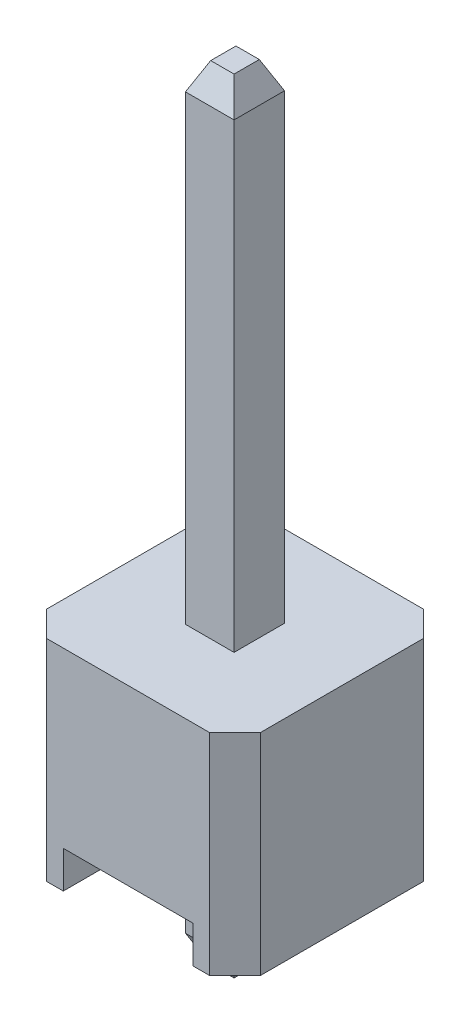
ISO-10303-21;
HEADER;
FILE_DESCRIPTION(('STEP AP214'),'2;1');
FILE_NAME('part.step','',(''),(''),'','','');
FILE_SCHEMA(('AUTOMOTIVE_DESIGN { 1 0 10303 214 1 1 1 1 }'));
ENDSEC;
DATA;
#1=APPLICATION_CONTEXT('core data for automotive mechanical design processes');
#2=APPLICATION_PROTOCOL_DEFINITION('international standard','automotive_design',2000,#1);
#3=PRODUCT_CONTEXT('',#1,'mechanical');
#4=PRODUCT('Part','Part','',(#3));
#5=PRODUCT_RELATED_PRODUCT_CATEGORY('part','',(#4));
#6=PRODUCT_DEFINITION_FORMATION('','',#4);
#7=PRODUCT_DEFINITION_CONTEXT('part definition',#1,'design');
#8=PRODUCT_DEFINITION('design','',#6,#7);
#9=PRODUCT_DEFINITION_SHAPE('','',#8);
#10=(LENGTH_UNIT() NAMED_UNIT(*) SI_UNIT(.MILLI.,.METRE.));
#11=(NAMED_UNIT(*) PLANE_ANGLE_UNIT() SI_UNIT($,.RADIAN.));
#12=(NAMED_UNIT(*) SI_UNIT($,.STERADIAN.) SOLID_ANGLE_UNIT());
#13=UNCERTAINTY_MEASURE_WITH_UNIT(LENGTH_MEASURE(1.E-05),#10,'distance_accuracy_value','');
#14=(GEOMETRIC_REPRESENTATION_CONTEXT(3) GLOBAL_UNCERTAINTY_ASSIGNED_CONTEXT((#13)) GLOBAL_UNIT_ASSIGNED_CONTEXT((#10,
#11,#12)) REPRESENTATION_CONTEXT('',''));
#15=CARTESIAN_POINT('',(0.,0.,0.));
#16=DIRECTION('',(0.,0.,1.));
#17=DIRECTION('',(1.,0.,0.));
#18=AXIS2_PLACEMENT_3D('',#15,#16,#17);
#19=CARTESIAN_POINT('',(-19.1812561045914,-5.69124998633488,0.951627111171994));
#20=DIRECTION('',(0.,-1.,0.));
#21=DIRECTION('',(0.,0.,-1.));
#22=AXIS2_PLACEMENT_3D('',#19,#20,#21);
#23=PLANE('',#22);
#24=DIRECTION('',(0.,0.,1.));
#25=VECTOR('',#24,1.);
#26=CARTESIAN_POINT('',(-19.0312561045914,-5.69124998633488,1.55162711117199));
#27=LINE('',#26,#25);
#28=CARTESIAN_POINT('',(-19.0312561045914,-5.69124998633488,1.40162711117199));
#29=VERTEX_POINT('',#28);
#30=CARTESIAN_POINT('',(-19.0312561045914,-5.69124998633488,1.10162711117199));
#31=VERTEX_POINT('',#30);
#32=EDGE_CURVE('E194',#29,#31,#27,.F.);
#33=ORIENTED_EDGE('',*,*,#32,.T.);
#34=DIRECTION('',(1.,0.,0.));
#35=VECTOR('',#34,1.);
#36=CARTESIAN_POINT('',(-19.1812561045914,-5.69124998633488,1.10162711117199));
#37=LINE('',#36,#35);
#38=CARTESIAN_POINT('',(-18.7537499744834,-5.69124998633488,1.10162711117199));
#39=VERTEX_POINT('',#38);
#40=EDGE_CURVE('E179',#31,#39,#37,.T.);
#41=ORIENTED_EDGE('',*,*,#40,.T.);
#42=DIRECTION('',(0.,0.,1.));
#43=VECTOR('',#42,1.);
#44=CARTESIAN_POINT('',(-18.7537499744834,-5.69124998633488,0.951627111171994));
#45=LINE('',#44,#43);
#46=CARTESIAN_POINT('',(-18.7537499744834,-5.69124998633488,1.40162711117199));
#47=VERTEX_POINT('',#46);
#48=EDGE_CURVE('E20',#39,#47,#45,.T.);
#49=ORIENTED_EDGE('',*,*,#48,.T.);
#50=DIRECTION('',(1.,0.,0.));
#51=VECTOR('',#50,1.);
#52=CARTESIAN_POINT('',(-18.6037499744834,-5.69124998633488,1.40162711117199));
#53=LINE('',#52,#51);
#54=EDGE_CURVE('E174',#47,#29,#53,.F.);
#55=ORIENTED_EDGE('',*,*,#54,.T.);
#56=EDGE_LOOP('',(#33,#41,#49,#55));
#57=FACE_BOUND('',#56,.T.);
#58=ADVANCED_FACE('F17',(#57),#23,.T.);
#59=CARTESIAN_POINT('',(-18.6037499744834,-5.36957394825845,0.951627111171994));
#60=DIRECTION('',(-0.90630778703665,0.4226182617407,0.));
#61=DIRECTION('',(-0.4226182617407,-0.90630778703665,0.));
#62=AXIS2_PLACEMENT_3D('',#59,#60,#61);
#63=PLANE('',#62);
#64=DIRECTION('',(0.,0.,-1.));
#65=VECTOR('',#64,1.);
#66=CARTESIAN_POINT('',(-18.6037499744834,-5.36957394825845,0.951627111171994));
#67=LINE('',#66,#65);
#68=CARTESIAN_POINT('',(-18.6037499744834,-5.36957394825845,1.55162711117199));
#69=VERTEX_POINT('',#68);
#70=CARTESIAN_POINT('',(-18.6037499744834,-5.36957394825845,0.951627111171994));
#71=VERTEX_POINT('',#70);
#72=EDGE_CURVE('E186',#69,#71,#67,.T.);
#73=ORIENTED_EDGE('',*,*,#72,.F.);
#74=DIRECTION('',(-0.389281620635035,-0.834817129478983,-0.389281620635025));
#75=VECTOR('',#74,1.);
#76=CARTESIAN_POINT('',(-18.6037499744834,-5.36957394825845,1.55162711117199));
#77=LINE('',#76,#75);
#78=EDGE_CURVE('E182',#69,#47,#77,.T.);
#79=ORIENTED_EDGE('',*,*,#78,.T.);
#80=ORIENTED_EDGE('',*,*,#48,.F.);
#81=DIRECTION('',(0.389281620635035,0.834817129478983,-0.389281620635025));
#82=VECTOR('',#81,1.);
#83=CARTESIAN_POINT('',(-18.7537499744834,-5.69124998633488,1.10162711117199));
#84=LINE('',#83,#82);
#85=EDGE_CURVE('E202',#39,#71,#84,.T.);
#86=ORIENTED_EDGE('',*,*,#85,.T.);
#87=EDGE_LOOP('',(#73,#79,#80,#86));
#88=FACE_BOUND('',#87,.T.);
#89=ADVANCED_FACE('F184',(#88),#63,.F.);
#90=CARTESIAN_POINT('',(-18.6037499744834,-5.36957394825845,1.55162711117199));
#91=DIRECTION('',(0.,0.422618261740701,-0.906307787036649));
#92=DIRECTION('',(0.,0.906307787036649,0.422618261740701));
#93=AXIS2_PLACEMENT_3D('',#90,#91,#92);
#94=PLANE('',#93);
#95=ORIENTED_EDGE('',*,*,#54,.F.);
#96=ORIENTED_EDGE('',*,*,#78,.F.);
#97=DIRECTION('',(1.,0.,0.));
#98=VECTOR('',#97,1.);
#99=CARTESIAN_POINT('',(-18.6037499744834,-5.36957394825845,1.55162711117199));
#100=LINE('',#99,#98);
#101=CARTESIAN_POINT('',(-19.1812561045914,-5.36957394825845,1.55162711117199));
#102=VERTEX_POINT('',#101);
#103=EDGE_CURVE('E205',#102,#69,#100,.T.);
#104=ORIENTED_EDGE('',*,*,#103,.F.);
#105=DIRECTION('',(0.389281620635027,-0.834817129478987,-0.389281620635025));
#106=VECTOR('',#105,1.);
#107=CARTESIAN_POINT('',(-19.1812561045914,-5.36957394825845,1.55162711117199));
#108=LINE('',#107,#106);
#109=EDGE_CURVE('E191',#102,#29,#108,.T.);
#110=ORIENTED_EDGE('',*,*,#109,.T.);
#111=EDGE_LOOP('',(#95,#96,#104,#110));
#112=FACE_BOUND('',#111,.T.);
#113=ADVANCED_FACE('F189',(#112),#94,.F.);
#114=CARTESIAN_POINT('',(-19.1812561045914,-5.36957394825845,1.55162711117199));
#115=DIRECTION('',(0.906307787036649,0.422618261740701,0.));
#116=DIRECTION('',(-0.422618261740701,0.906307787036649,0.));
#117=AXIS2_PLACEMENT_3D('',#114,#115,#116);
#118=PLANE('',#117);
#119=ORIENTED_EDGE('',*,*,#32,.F.);
#120=ORIENTED_EDGE('',*,*,#109,.F.);
#121=DIRECTION('',(0.,0.,1.));
#122=VECTOR('',#121,1.);
#123=CARTESIAN_POINT('',(-19.1812561045914,-5.36957394825845,1.55162711117199));
#124=LINE('',#123,#122);
#125=CARTESIAN_POINT('',(-19.1812561045914,-5.36957394825845,0.951627111171994));
#126=VERTEX_POINT('',#125);
#127=EDGE_CURVE('E211',#126,#102,#124,.T.);
#128=ORIENTED_EDGE('',*,*,#127,.F.);
#129=DIRECTION('',(0.389281620635027,-0.834817129478986,0.389281620635026));
#130=VECTOR('',#129,1.);
#131=CARTESIAN_POINT('',(-19.1812561045914,-5.36957394825845,0.951627111171994));
#132=LINE('',#131,#130);
#133=EDGE_CURVE('E198',#126,#31,#132,.T.);
#134=ORIENTED_EDGE('',*,*,#133,.T.);
#135=EDGE_LOOP('',(#119,#120,#128,#134));
#136=FACE_BOUND('',#135,.T.);
#137=ADVANCED_FACE('F518',(#136),#118,.F.);
#138=CARTESIAN_POINT('',(-19.1812561045914,-5.36957394825845,0.951627111171994));
#139=DIRECTION('',(0.,0.422618261740701,0.906307787036649));
#140=DIRECTION('',(0.,-0.906307787036649,0.422618261740701));
#141=AXIS2_PLACEMENT_3D('',#138,#139,#140);
#142=PLANE('',#141);
#143=ORIENTED_EDGE('',*,*,#40,.F.);
#144=ORIENTED_EDGE('',*,*,#133,.F.);
#145=DIRECTION('',(-1.,0.,0.));
#146=VECTOR('',#145,1.);
#147=CARTESIAN_POINT('',(-19.1812561045914,-5.36957394825845,0.951627111171994));
#148=LINE('',#147,#146);
#149=EDGE_CURVE('E220',#71,#126,#148,.T.);
#150=ORIENTED_EDGE('',*,*,#149,.F.);
#151=ORIENTED_EDGE('',*,*,#85,.F.);
#152=EDGE_LOOP('',(#143,#144,#150,#151));
#153=FACE_BOUND('',#152,.T.);
#154=ADVANCED_FACE('F514',(#153),#142,.F.);
#155=CARTESIAN_POINT('',(-18.6037499744834,-5.69124998633488,0.951627111171994));
#156=DIRECTION('',(1.,0.,0.));
#157=DIRECTION('',(0.,0.,-1.));
#158=AXIS2_PLACEMENT_3D('',#155,#156,#157);
#159=PLANE('',#158);
#160=DIRECTION('',(0.,1.,0.));
#161=VECTOR('',#160,1.);
#162=CARTESIAN_POINT('',(-18.6037499744834,-5.69124998633488,0.951627111171994));
#163=LINE('',#162,#161);
#164=CARTESIAN_POINT('',(-18.6037499744834,-4.25124998633488,0.951627111171994));
#165=VERTEX_POINT('',#164);
#166=EDGE_CURVE('E217',#165,#71,#163,.F.);
#167=ORIENTED_EDGE('',*,*,#166,.F.);
#168=DIRECTION('',(0.,0.,1.));
#169=VECTOR('',#168,1.);
#170=CARTESIAN_POINT('',(-18.6037499744834,-4.25124998633488,2.52162711117199));
#171=LINE('',#170,#169);
#172=CARTESIAN_POINT('',(-18.6037499744834,-4.25124998633488,1.55162711117199));
#173=VERTEX_POINT('',#172);
#174=EDGE_CURVE('E230',#165,#173,#171,.T.);
#175=ORIENTED_EDGE('',*,*,#174,.T.);
#176=DIRECTION('',(0.,1.,0.));
#177=VECTOR('',#176,1.);
#178=CARTESIAN_POINT('',(-18.6037499744834,-5.69124998633488,1.55162711117199));
#179=LINE('',#178,#177);
#180=EDGE_CURVE('E208',#69,#173,#179,.T.);
#181=ORIENTED_EDGE('',*,*,#180,.F.);
#182=ORIENTED_EDGE('',*,*,#72,.T.);
#183=EDGE_LOOP('',(#167,#175,#181,#182));
#184=FACE_BOUND('',#183,.T.);
#185=ADVANCED_FACE('F510',(#184),#159,.T.);
#186=CARTESIAN_POINT('',(-18.6037499744834,-5.69124998633488,1.55162711117199));
#187=DIRECTION('',(0.,0.,1.));
#188=DIRECTION('',(1.,0.,0.));
#189=AXIS2_PLACEMENT_3D('',#186,#187,#188);
#190=PLANE('',#189);
#191=ORIENTED_EDGE('',*,*,#180,.T.);
#192=DIRECTION('',(1.,0.,0.));
#193=VECTOR('',#192,1.);
#194=CARTESIAN_POINT('',(-18.1225030395374,-4.25124998633488,1.55162711117199));
#195=LINE('',#194,#193);
#196=CARTESIAN_POINT('',(-19.1812561045914,-4.25124998633488,1.55162711117199));
#197=VERTEX_POINT('',#196);
#198=EDGE_CURVE('E232',#173,#197,#195,.F.);
#199=ORIENTED_EDGE('',*,*,#198,.T.);
#200=DIRECTION('',(0.,1.,0.));
#201=VECTOR('',#200,1.);
#202=CARTESIAN_POINT('',(-19.1812561045914,-5.69124998633488,1.55162711117199));
#203=LINE('',#202,#201);
#204=EDGE_CURVE('E214',#102,#197,#203,.T.);
#205=ORIENTED_EDGE('',*,*,#204,.F.);
#206=ORIENTED_EDGE('',*,*,#103,.T.);
#207=EDGE_LOOP('',(#191,#199,#205,#206));
#208=FACE_BOUND('',#207,.T.);
#209=ADVANCED_FACE('F506',(#208),#190,.T.);
#210=CARTESIAN_POINT('',(-19.1812561045914,-5.69124998633488,1.55162711117199));
#211=DIRECTION('',(-1.,0.,0.));
#212=DIRECTION('',(0.,0.,1.));
#213=AXIS2_PLACEMENT_3D('',#210,#211,#212);
#214=PLANE('',#213);
#215=ORIENTED_EDGE('',*,*,#204,.T.);
#216=DIRECTION('',(0.,0.,1.));
#217=VECTOR('',#216,1.);
#218=CARTESIAN_POINT('',(-19.1812561045914,-4.25124998633488,2.52162711117199));
#219=LINE('',#218,#217);
#220=CARTESIAN_POINT('',(-19.1812561045914,-4.25124998633488,0.951627111171994));
#221=VERTEX_POINT('',#220);
#222=EDGE_CURVE('E234',#197,#221,#219,.F.);
#223=ORIENTED_EDGE('',*,*,#222,.T.);
#224=DIRECTION('',(0.,1.,0.));
#225=VECTOR('',#224,1.);
#226=CARTESIAN_POINT('',(-19.1812561045914,-5.69124998633488,0.951627111171994));
#227=LINE('',#226,#225);
#228=EDGE_CURVE('E223',#126,#221,#227,.T.);
#229=ORIENTED_EDGE('',*,*,#228,.F.);
#230=ORIENTED_EDGE('',*,*,#127,.T.);
#231=EDGE_LOOP('',(#215,#223,#229,#230));
#232=FACE_BOUND('',#231,.T.);
#233=ADVANCED_FACE('F502',(#232),#214,.T.);
#234=CARTESIAN_POINT('',(-19.1812561045914,-5.69124998633488,0.951627111171994));
#235=DIRECTION('',(0.,0.,-1.));
#236=DIRECTION('',(-1.,0.,0.));
#237=AXIS2_PLACEMENT_3D('',#234,#235,#236);
#238=PLANE('',#237);
#239=ORIENTED_EDGE('',*,*,#228,.T.);
#240=DIRECTION('',(1.,0.,0.));
#241=VECTOR('',#240,1.);
#242=CARTESIAN_POINT('',(-18.1225030395374,-4.25124998633488,0.951627111171994));
#243=LINE('',#242,#241);
#244=EDGE_CURVE('E236',#221,#165,#243,.T.);
#245=ORIENTED_EDGE('',*,*,#244,.T.);
#246=ORIENTED_EDGE('',*,*,#166,.T.);
#247=ORIENTED_EDGE('',*,*,#149,.T.);
#248=EDGE_LOOP('',(#239,#245,#246,#247));
#249=FACE_BOUND('',#248,.T.);
#250=ADVANCED_FACE('F498',(#249),#238,.T.);
#251=CARTESIAN_POINT('',(-18.1225030395374,-4.25124998633488,2.52162711117199));
#252=DIRECTION('',(0.,1.,0.));
#253=DIRECTION('',(0.,0.,1.));
#254=AXIS2_PLACEMENT_3D('',#251,#252,#253);
#255=PLANE('',#254);
#256=ORIENTED_EDGE('',*,*,#222,.F.);
#257=ORIENTED_EDGE('',*,*,#198,.F.);
#258=ORIENTED_EDGE('',*,*,#174,.F.);
#259=ORIENTED_EDGE('',*,*,#244,.F.);
#260=EDGE_LOOP('',(#256,#257,#258,#259));
#261=FACE_BOUND('',#260,.T.);
#262=DIRECTION('',(0.,0.,1.));
#263=VECTOR('',#262,1.);
#264=CARTESIAN_POINT('',(-19.6625030395374,-4.25124998633488,2.52162711117199));
#265=LINE('',#264,#263);
#266=CARTESIAN_POINT('',(-19.6625030395374,-4.25124998633488,2.52162711117199));
#267=VERTEX_POINT('',#266);
#268=CARTESIAN_POINT('',(-19.6625030395374,-4.25124998633488,-0.0183728888280069));
#269=VERTEX_POINT('',#268);
#270=EDGE_CURVE('E241',#267,#269,#265,.F.);
#271=ORIENTED_EDGE('',*,*,#270,.T.);
#272=DIRECTION('',(1.,0.,0.));
#273=VECTOR('',#272,1.);
#274=CARTESIAN_POINT('',(-18.1225030395374,-4.25124998633488,-0.0183728888280069));
#275=LINE('',#274,#273);
#276=CARTESIAN_POINT('',(-18.1225030395374,-4.25124998633488,-0.0183728888280069));
#277=VERTEX_POINT('',#276);
#278=EDGE_CURVE('E226',#277,#269,#275,.F.);
#279=ORIENTED_EDGE('',*,*,#278,.F.);
#280=DIRECTION('',(0.,0.,-1.));
#281=VECTOR('',#280,1.);
#282=CARTESIAN_POINT('',(-18.1225030395374,-4.25124998633488,2.52162711117199));
#283=LINE('',#282,#281);
#284=CARTESIAN_POINT('',(-18.1225030395374,-4.25124998633488,2.52162711117199));
#285=VERTEX_POINT('',#284);
#286=EDGE_CURVE('E248',#277,#285,#283,.F.);
#287=ORIENTED_EDGE('',*,*,#286,.T.);
#288=DIRECTION('',(1.,0.,0.));
#289=VECTOR('',#288,1.);
#290=CARTESIAN_POINT('',(-18.1225030395374,-4.25124998633488,2.52162711117199));
#291=LINE('',#290,#289);
#292=EDGE_CURVE('E228',#267,#285,#291,.T.);
#293=ORIENTED_EDGE('',*,*,#292,.F.);
#294=EDGE_LOOP('',(#271,#279,#287,#293));
#295=FACE_BOUND('',#294,.T.);
#296=ADVANCED_FACE('F495',(#261,#295),#255,.F.);
#297=CARTESIAN_POINT('',(-19.1812561045914,3.60875001366512,1.10162711117199));
#298=DIRECTION('',(0.,0.422618261740697,-0.906307787036651));
#299=DIRECTION('',(0.,0.906307787036651,0.422618261740697));
#300=AXIS2_PLACEMENT_3D('',#297,#298,#299);
#301=PLANE('',#300);
#302=DIRECTION('',(-0.389281620635024,-0.83481712947899,-0.389281620635022));
#303=VECTOR('',#302,1.);
#304=CARTESIAN_POINT('',(-19.0312561045914,3.60875001366512,1.10162711117199));
#305=LINE('',#304,#303);
#306=CARTESIAN_POINT('',(-19.0312561045914,3.60875001366512,1.10162711117199));
#307=VERTEX_POINT('',#306);
#308=CARTESIAN_POINT('',(-19.1812561045914,3.28707397558869,0.951627111171994));
#309=VERTEX_POINT('',#308);
#310=EDGE_CURVE('E263',#307,#309,#305,.T.);
#311=ORIENTED_EDGE('',*,*,#310,.F.);
#312=DIRECTION('',(1.,0.,0.));
#313=VECTOR('',#312,1.);
#314=CARTESIAN_POINT('',(-19.1812561045914,3.60875001366512,1.10162711117199));
#315=LINE('',#314,#313);
#316=CARTESIAN_POINT('',(-18.7537499744834,3.60875001366512,1.10162711117199));
#317=VERTEX_POINT('',#316);
#318=EDGE_CURVE('E256',#307,#317,#315,.T.);
#319=ORIENTED_EDGE('',*,*,#318,.T.);
#320=DIRECTION('',(-0.389281620635023,0.83481712947899,0.389281620635021));
#321=VECTOR('',#320,1.);
#322=CARTESIAN_POINT('',(-18.6037499744834,3.28707397558868,0.951627111171994));
#323=LINE('',#322,#321);
#324=CARTESIAN_POINT('',(-18.6037499744834,3.28707397558869,0.951627111171994));
#325=VERTEX_POINT('',#324);
#326=EDGE_CURVE('E253',#325,#317,#323,.T.);
#327=ORIENTED_EDGE('',*,*,#326,.F.);
#328=DIRECTION('',(-1.,0.,0.));
#329=VECTOR('',#328,1.);
#330=CARTESIAN_POINT('',(-19.1812561045914,3.28707397558869,0.951627111171994));
#331=LINE('',#330,#329);
#332=EDGE_CURVE('E266',#309,#325,#331,.F.);
#333=ORIENTED_EDGE('',*,*,#332,.F.);
#334=EDGE_LOOP('',(#311,#319,#327,#333));
#335=FACE_BOUND('',#334,.T.);
#336=ADVANCED_FACE('F472',(#335),#301,.T.);
#337=CARTESIAN_POINT('',(-19.6625030395374,-4.25124998633488,2.52162711117199));
#338=DIRECTION('',(-1.,0.,0.));
#339=DIRECTION('',(0.,0.,1.));
#340=AXIS2_PLACEMENT_3D('',#337,#338,#339);
#341=PLANE('',#340);
#342=DIRECTION('',(0.,1.,0.));
#343=VECTOR('',#342,1.);
#344=CARTESIAN_POINT('',(-19.6625030395374,-4.25124998633488,-0.0183728888280069));
#345=LINE('',#344,#343);
#346=CARTESIAN_POINT('',(-19.6625030395374,-4.69124998633488,-0.0183728888280069));
#347=VERTEX_POINT('',#346);
#348=EDGE_CURVE('E244',#269,#347,#345,.F.);
#349=ORIENTED_EDGE('',*,*,#348,.F.);
#350=ORIENTED_EDGE('',*,*,#270,.F.);
#351=DIRECTION('',(0.,1.,0.));
#352=VECTOR('',#351,1.);
#353=CARTESIAN_POINT('',(-19.6625030395374,-4.25124998633488,2.52162711117199));
#354=LINE('',#353,#352);
#355=CARTESIAN_POINT('',(-19.6625030395374,-4.69124998633488,2.52162711117199));
#356=VERTEX_POINT('',#355);
#357=EDGE_CURVE('E239',#356,#267,#354,.T.);
#358=ORIENTED_EDGE('',*,*,#357,.F.);
#359=DIRECTION('',(0.,0.,1.));
#360=VECTOR('',#359,1.);
#361=CARTESIAN_POINT('',(-19.6625030395374,-4.69124998633488,1.25162711117199));
#362=LINE('',#361,#360);
#363=EDGE_CURVE('E273',#356,#347,#362,.F.);
#364=ORIENTED_EDGE('',*,*,#363,.T.);
#365=EDGE_LOOP('',(#349,#350,#358,#364));
#366=FACE_BOUND('',#365,.T.);
#367=ADVANCED_FACE('F488',(#366),#341,.F.);
#368=CARTESIAN_POINT('',(-18.1225030395374,-4.25124998633488,2.52162711117199));
#369=DIRECTION('',(1.,0.,0.));
#370=DIRECTION('',(0.,0.,-1.));
#371=AXIS2_PLACEMENT_3D('',#368,#369,#370);
#372=PLANE('',#371);
#373=DIRECTION('',(0.,1.,0.));
#374=VECTOR('',#373,1.);
#375=CARTESIAN_POINT('',(-18.1225030395374,-4.25124998633488,2.52162711117199));
#376=LINE('',#375,#374);
#377=CARTESIAN_POINT('',(-18.1225030395374,-4.69124998633488,2.52162711117199));
#378=VERTEX_POINT('',#377);
#379=EDGE_CURVE('E251',#285,#378,#376,.F.);
#380=ORIENTED_EDGE('',*,*,#379,.F.);
#381=ORIENTED_EDGE('',*,*,#286,.F.);
#382=DIRECTION('',(0.,1.,0.));
#383=VECTOR('',#382,1.);
#384=CARTESIAN_POINT('',(-18.1225030395374,-4.25124998633488,-0.0183728888280069));
#385=LINE('',#384,#383);
#386=CARTESIAN_POINT('',(-18.1225030395374,-4.69124998633488,-0.018372888828007));
#387=VERTEX_POINT('',#386);
#388=EDGE_CURVE('E246',#387,#277,#385,.T.);
#389=ORIENTED_EDGE('',*,*,#388,.F.);
#390=DIRECTION('',(0.,0.,1.));
#391=VECTOR('',#390,1.);
#392=CARTESIAN_POINT('',(-18.1225030395374,-4.69124998633488,1.25162711117199));
#393=LINE('',#392,#391);
#394=EDGE_CURVE('E288',#387,#378,#393,.T.);
#395=ORIENTED_EDGE('',*,*,#394,.T.);
#396=EDGE_LOOP('',(#380,#381,#389,#395));
#397=FACE_BOUND('',#396,.T.);
#398=ADVANCED_FACE('F482',(#397),#372,.F.);
#399=CARTESIAN_POINT('',(-18.7537499744834,3.60875001366512,0.951627111171993));
#400=DIRECTION('',(0.906307787036651,0.422618261740697,0.));
#401=DIRECTION('',(-0.422618261740697,0.906307787036651,0.));
#402=AXIS2_PLACEMENT_3D('',#399,#400,#401);
#403=PLANE('',#402);
#404=ORIENTED_EDGE('',*,*,#326,.T.);
#405=DIRECTION('',(0.,0.,-1.));
#406=VECTOR('',#405,1.);
#407=CARTESIAN_POINT('',(-18.7537499744834,3.60875001366512,0.951627111171994));
#408=LINE('',#407,#406);
#409=CARTESIAN_POINT('',(-18.7537499744834,3.60875001366512,1.40162711117199));
#410=VERTEX_POINT('',#409);
#411=EDGE_CURVE('E258',#317,#410,#408,.F.);
#412=ORIENTED_EDGE('',*,*,#411,.T.);
#413=DIRECTION('',(-0.389281620635032,0.834817129478986,-0.389281620635021));
#414=VECTOR('',#413,1.);
#415=CARTESIAN_POINT('',(-18.6037499744834,3.28707397558869,1.55162711117199));
#416=LINE('',#415,#414);
#417=CARTESIAN_POINT('',(-18.6037499744834,3.28707397558869,1.55162711117199));
#418=VERTEX_POINT('',#417);
#419=EDGE_CURVE('E310',#418,#410,#416,.T.);
#420=ORIENTED_EDGE('',*,*,#419,.F.);
#421=DIRECTION('',(0.,0.,-1.));
#422=VECTOR('',#421,1.);
#423=CARTESIAN_POINT('',(-18.6037499744834,3.28707397558869,0.951627111171994));
#424=LINE('',#423,#422);
#425=EDGE_CURVE('E303',#325,#418,#424,.F.);
#426=ORIENTED_EDGE('',*,*,#425,.F.);
#427=EDGE_LOOP('',(#404,#412,#420,#426));
#428=FACE_BOUND('',#427,.T.);
#429=ADVANCED_FACE('F466',(#428),#403,.T.);
#430=CARTESIAN_POINT('',(-19.1812561045914,3.60875001366512,0.951627111171994));
#431=DIRECTION('',(0.,-1.,0.));
#432=DIRECTION('',(0.,0.,-1.));
#433=AXIS2_PLACEMENT_3D('',#430,#431,#432);
#434=PLANE('',#433);
#435=ORIENTED_EDGE('',*,*,#318,.F.);
#436=DIRECTION('',(0.,0.,1.));
#437=VECTOR('',#436,1.);
#438=CARTESIAN_POINT('',(-19.0312561045914,3.60875001366512,0.951627111171994));
#439=LINE('',#438,#437);
#440=CARTESIAN_POINT('',(-19.0312561045914,3.60875001366512,1.40162711117199));
#441=VERTEX_POINT('',#440);
#442=EDGE_CURVE('E260',#441,#307,#439,.F.);
#443=ORIENTED_EDGE('',*,*,#442,.F.);
#444=DIRECTION('',(1.,0.,0.));
#445=VECTOR('',#444,1.);
#446=CARTESIAN_POINT('',(-19.1812561045914,3.60875001366512,1.40162711117199));
#447=LINE('',#446,#445);
#448=EDGE_CURVE('E313',#410,#441,#447,.F.);
#449=ORIENTED_EDGE('',*,*,#448,.F.);
#450=ORIENTED_EDGE('',*,*,#411,.F.);
#451=EDGE_LOOP('',(#435,#443,#449,#450));
#452=FACE_BOUND('',#451,.T.);
#453=ADVANCED_FACE('F474',(#452),#434,.F.);
#454=CARTESIAN_POINT('',(-19.0312561045914,3.60875001366512,0.951627111171994));
#455=DIRECTION('',(-0.906307787036651,0.422618261740697,0.));
#456=DIRECTION('',(-0.422618261740697,-0.906307787036651,0.));
#457=AXIS2_PLACEMENT_3D('',#454,#455,#456);
#458=PLANE('',#457);
#459=ORIENTED_EDGE('',*,*,#310,.T.);
#460=DIRECTION('',(0.,0.,1.));
#461=VECTOR('',#460,1.);
#462=CARTESIAN_POINT('',(-19.1812561045914,3.28707397558869,1.55162711117199));
#463=LINE('',#462,#461);
#464=CARTESIAN_POINT('',(-19.1812561045914,3.28707397558869,1.55162711117199));
#465=VERTEX_POINT('',#464);
#466=EDGE_CURVE('E316',#465,#309,#463,.F.);
#467=ORIENTED_EDGE('',*,*,#466,.F.);
#468=DIRECTION('',(-0.389281620635025,-0.834817129478989,0.389281620635023));
#469=VECTOR('',#468,1.);
#470=CARTESIAN_POINT('',(-19.0312561045914,3.60875001366512,1.40162711117199));
#471=LINE('',#470,#469);
#472=EDGE_CURVE('E307',#441,#465,#471,.T.);
#473=ORIENTED_EDGE('',*,*,#472,.F.);
#474=ORIENTED_EDGE('',*,*,#442,.T.);
#475=EDGE_LOOP('',(#459,#467,#473,#474));
#476=FACE_BOUND('',#475,.T.);
#477=ADVANCED_FACE('F471',(#476),#458,.T.);
#478=CARTESIAN_POINT('',(-19.1812561045914,-5.69124998633488,0.951627111171994));
#479=DIRECTION('',(0.,0.,-1.));
#480=DIRECTION('',(-1.,0.,0.));
#481=AXIS2_PLACEMENT_3D('',#478,#479,#480);
#482=PLANE('',#481);
#483=DIRECTION('',(0.,1.,0.));
#484=VECTOR('',#483,1.);
#485=CARTESIAN_POINT('',(-18.6037499744834,-5.69124998633488,0.951627111171994));
#486=LINE('',#485,#484);
#487=CARTESIAN_POINT('',(-18.6037499744834,-2.19124998633488,0.951627111171994));
#488=VERTEX_POINT('',#487);
#489=EDGE_CURVE('E300',#488,#325,#486,.T.);
#490=ORIENTED_EDGE('',*,*,#489,.F.);
#491=DIRECTION('',(-1.,0.,0.));
#492=VECTOR('',#491,1.);
#493=CARTESIAN_POINT('',(-19.1812561045914,-2.19124998633488,0.951627111171994));
#494=LINE('',#493,#492);
#495=CARTESIAN_POINT('',(-19.1812561045914,-2.19124998633488,0.951627111171994));
#496=VERTEX_POINT('',#495);
#497=EDGE_CURVE('E269',#488,#496,#494,.T.);
#498=ORIENTED_EDGE('',*,*,#497,.T.);
#499=DIRECTION('',(0.,1.,0.));
#500=VECTOR('',#499,1.);
#501=CARTESIAN_POINT('',(-19.1812561045914,-5.69124998633488,0.951627111171994));
#502=LINE('',#501,#500);
#503=EDGE_CURVE('E319',#309,#496,#502,.F.);
#504=ORIENTED_EDGE('',*,*,#503,.F.);
#505=ORIENTED_EDGE('',*,*,#332,.T.);
#506=EDGE_LOOP('',(#490,#498,#504,#505));
#507=FACE_BOUND('',#506,.T.);
#508=ADVANCED_FACE('F462',(#507),#482,.T.);
#509=CARTESIAN_POINT('',(-21.1325030395374,-4.69124998633488,1.25162711117199));
#510=DIRECTION('',(0.,1.,0.));
#511=DIRECTION('',(0.,0.,1.));
#512=AXIS2_PLACEMENT_3D('',#509,#510,#511);
#513=PLANE('',#512);
#514=ORIENTED_EDGE('',*,*,#363,.F.);
#515=DIRECTION('',(1.,0.,0.));
#516=VECTOR('',#515,1.);
#517=CARTESIAN_POINT('',(-21.1325030395374,-4.69124998633488,2.52162711117199));
#518=LINE('',#517,#516);
#519=CARTESIAN_POINT('',(-19.8625030395374,-4.69124998633488,2.52162711117199));
#520=VERTEX_POINT('',#519);
#521=EDGE_CURVE('E271',#520,#356,#518,.T.);
#522=ORIENTED_EDGE('',*,*,#521,.F.);
#523=DIRECTION('',(-0.707106781186549,0.,-0.707106781186546));
#524=VECTOR('',#523,1.);
#525=CARTESIAN_POINT('',(-20.1625030395374,-4.69124998633488,2.22162711117199));
#526=LINE('',#525,#524);
#527=CARTESIAN_POINT('',(-20.1625030395374,-4.69124998633488,2.22162711117199));
#528=VERTEX_POINT('',#527);
#529=EDGE_CURVE('E280',#520,#528,#526,.T.);
#530=ORIENTED_EDGE('',*,*,#529,.T.);
#531=DIRECTION('',(0.,0.,-1.));
#532=VECTOR('',#531,1.);
#533=CARTESIAN_POINT('',(-20.1625030395374,-4.69124998633488,0.281627111171992));
#534=LINE('',#533,#532);
#535=CARTESIAN_POINT('',(-20.1625030395374,-4.69124998633488,0.281627111171992));
#536=VERTEX_POINT('',#535);
#537=EDGE_CURVE('E330',#528,#536,#534,.T.);
#538=ORIENTED_EDGE('',*,*,#537,.T.);
#539=DIRECTION('',(0.707106781186549,0.,-0.707106781186546));
#540=VECTOR('',#539,1.);
#541=CARTESIAN_POINT('',(-19.8625030395374,-4.69124998633488,-0.018372888828007));
#542=LINE('',#541,#540);
#543=CARTESIAN_POINT('',(-19.8625030395374,-4.69124998633488,-0.018372888828007));
#544=VERTEX_POINT('',#543);
#545=EDGE_CURVE('E297',#536,#544,#542,.T.);
#546=ORIENTED_EDGE('',*,*,#545,.T.);
#547=DIRECTION('',(1.,0.,0.));
#548=VECTOR('',#547,1.);
#549=CARTESIAN_POINT('',(-21.1325030395374,-4.69124998633488,-0.0183728888280071));
#550=LINE('',#549,#548);
#551=EDGE_CURVE('E276',#347,#544,#550,.F.);
#552=ORIENTED_EDGE('',*,*,#551,.F.);
#553=EDGE_LOOP('',(#514,#522,#530,#538,#546,#552));
#554=FACE_BOUND('',#553,.T.);
#555=ADVANCED_FACE('F655',(#554),#513,.F.);
#556=CARTESIAN_POINT('',(-20.1625030395374,-2.19124998633488,2.22162711117199));
#557=DIRECTION('',(0.707106781186546,0.,-0.707106781186549));
#558=DIRECTION('',(-0.707106781186549,0.,-0.707106781186546));
#559=AXIS2_PLACEMENT_3D('',#556,#557,#558);
#560=PLANE('',#559);
#561=DIRECTION('',(0.,1.,0.));
#562=VECTOR('',#561,1.);
#563=CARTESIAN_POINT('',(-19.8625030395374,-2.19124998633488,2.52162711117199));
#564=LINE('',#563,#562);
#565=CARTESIAN_POINT('',(-19.8625030395374,-2.19124998633488,2.52162711117199));
#566=VERTEX_POINT('',#565);
#567=EDGE_CURVE('E333',#520,#566,#564,.T.);
#568=ORIENTED_EDGE('',*,*,#567,.T.);
#569=DIRECTION('',(-0.707106781186549,0.,-0.707106781186546));
#570=VECTOR('',#569,1.);
#571=CARTESIAN_POINT('',(-20.1625030395374,-2.19124998633488,2.22162711117199));
#572=LINE('',#571,#570);
#573=CARTESIAN_POINT('',(-20.1625030395374,-2.19124998633488,2.22162711117199));
#574=VERTEX_POINT('',#573);
#575=EDGE_CURVE('E278',#574,#566,#572,.F.);
#576=ORIENTED_EDGE('',*,*,#575,.F.);
#577=DIRECTION('',(0.,1.,0.));
#578=VECTOR('',#577,1.);
#579=CARTESIAN_POINT('',(-20.1625030395374,-2.19124998633488,2.22162711117199));
#580=LINE('',#579,#578);
#581=EDGE_CURVE('E327',#574,#528,#580,.F.);
#582=ORIENTED_EDGE('',*,*,#581,.T.);
#583=ORIENTED_EDGE('',*,*,#529,.F.);
#584=EDGE_LOOP('',(#568,#576,#582,#583));
#585=FACE_BOUND('',#584,.T.);
#586=ADVANCED_FACE('F395',(#585),#560,.F.);
#587=CARTESIAN_POINT('',(-17.9225030395374,-2.19124998633488,2.52162711117199));
#588=DIRECTION('',(-0.707106781186549,0.,-0.707106781186546));
#589=DIRECTION('',(-0.707106781186546,0.,0.707106781186549));
#590=AXIS2_PLACEMENT_3D('',#587,#588,#589);
#591=PLANE('',#590);
#592=DIRECTION('',(0.,1.,0.));
#593=VECTOR('',#592,1.);
#594=CARTESIAN_POINT('',(-17.6225030395374,-2.19124998633488,2.22162711117199));
#595=LINE('',#594,#593);
#596=CARTESIAN_POINT('',(-17.6225030395374,-4.69124998633488,2.22162711117199));
#597=VERTEX_POINT('',#596);
#598=CARTESIAN_POINT('',(-17.6225030395374,-2.19124998633488,2.22162711117199));
#599=VERTEX_POINT('',#598);
#600=EDGE_CURVE('E341',#597,#599,#595,.T.);
#601=ORIENTED_EDGE('',*,*,#600,.T.);
#602=DIRECTION('',(-0.707106781186546,0.,0.707106781186549));
#603=VECTOR('',#602,1.);
#604=CARTESIAN_POINT('',(-17.9225030395374,-2.19124998633488,2.52162711117199));
#605=LINE('',#604,#603);
#606=CARTESIAN_POINT('',(-17.9225030395374,-2.19124998633488,2.52162711117199));
#607=VERTEX_POINT('',#606);
#608=EDGE_CURVE('E282',#607,#599,#605,.F.);
#609=ORIENTED_EDGE('',*,*,#608,.F.);
#610=DIRECTION('',(0.,1.,0.));
#611=VECTOR('',#610,1.);
#612=CARTESIAN_POINT('',(-17.9225030395374,-2.19124998633488,2.52162711117199));
#613=LINE('',#612,#611);
#614=CARTESIAN_POINT('',(-17.9225030395374,-4.69124998633488,2.52162711117199));
#615=VERTEX_POINT('',#614);
#616=EDGE_CURVE('E336',#607,#615,#613,.F.);
#617=ORIENTED_EDGE('',*,*,#616,.T.);
#618=DIRECTION('',(0.707106781186545,0.,-0.70710678118655));
#619=VECTOR('',#618,1.);
#620=CARTESIAN_POINT('',(-17.9225030395374,-4.69124998633488,2.52162711117199));
#621=LINE('',#620,#619);
#622=EDGE_CURVE('E284',#615,#597,#621,.T.);
#623=ORIENTED_EDGE('',*,*,#622,.T.);
#624=EDGE_LOOP('',(#601,#609,#617,#623));
#625=FACE_BOUND('',#624,.T.);
#626=ADVANCED_FACE('F402',(#625),#591,.F.);
#627=CARTESIAN_POINT('',(-21.1325030395374,-4.69124998633488,1.25162711117199));
#628=DIRECTION('',(0.,1.,0.));
#629=DIRECTION('',(0.,0.,1.));
#630=AXIS2_PLACEMENT_3D('',#627,#628,#629);
#631=PLANE('',#630);
#632=ORIENTED_EDGE('',*,*,#394,.F.);
#633=DIRECTION('',(1.,0.,0.));
#634=VECTOR('',#633,1.);
#635=CARTESIAN_POINT('',(-21.1325030395374,-4.69124998633488,-0.0183728888280071));
#636=LINE('',#635,#634);
#637=CARTESIAN_POINT('',(-17.9225030395374,-4.69124998633488,-0.0183728888280068));
#638=VERTEX_POINT('',#637);
#639=EDGE_CURVE('E286',#638,#387,#636,.F.);
#640=ORIENTED_EDGE('',*,*,#639,.F.);
#641=DIRECTION('',(0.707106781186547,0.,0.707106781186548));
#642=VECTOR('',#641,1.);
#643=CARTESIAN_POINT('',(-17.6225030395374,-4.69124998633488,0.281627111171993));
#644=LINE('',#643,#642);
#645=CARTESIAN_POINT('',(-17.6225030395374,-4.69124998633488,0.281627111171993));
#646=VERTEX_POINT('',#645);
#647=EDGE_CURVE('E293',#638,#646,#644,.T.);
#648=ORIENTED_EDGE('',*,*,#647,.T.);
#649=DIRECTION('',(0.,0.,1.));
#650=VECTOR('',#649,1.);
#651=CARTESIAN_POINT('',(-17.6225030395374,-4.69124998633488,2.22162711117199));
#652=LINE('',#651,#650);
#653=EDGE_CURVE('E347',#646,#597,#652,.T.);
#654=ORIENTED_EDGE('',*,*,#653,.T.);
#655=ORIENTED_EDGE('',*,*,#622,.F.);
#656=DIRECTION('',(-1.,0.,0.));
#657=VECTOR('',#656,1.);
#658=CARTESIAN_POINT('',(-19.8625030395374,-4.69124998633488,2.52162711117199));
#659=LINE('',#658,#657);
#660=EDGE_CURVE('E338',#615,#378,#659,.T.);
#661=ORIENTED_EDGE('',*,*,#660,.T.);
#662=EDGE_LOOP('',(#632,#640,#648,#654,#655,#661));
#663=FACE_BOUND('',#662,.T.);
#664=ADVANCED_FACE('F405',(#663),#631,.F.);
#665=CARTESIAN_POINT('',(-17.6225030395374,-2.19124998633488,0.281627111171993));
#666=DIRECTION('',(-0.707106781186548,0.,0.707106781186547));
#667=DIRECTION('',(0.707106781186547,0.,0.707106781186548));
#668=AXIS2_PLACEMENT_3D('',#665,#666,#667);
#669=PLANE('',#668);
#670=DIRECTION('',(0.,1.,0.));
#671=VECTOR('',#670,1.);
#672=CARTESIAN_POINT('',(-17.9225030395374,-2.19124998633488,-0.018372888828007));
#673=LINE('',#672,#671);
#674=CARTESIAN_POINT('',(-17.9225030395374,-2.19124998633488,-0.0183728888280066));
#675=VERTEX_POINT('',#674);
#676=EDGE_CURVE('E350',#638,#675,#673,.T.);
#677=ORIENTED_EDGE('',*,*,#676,.T.);
#678=DIRECTION('',(0.707106781186547,0.,0.707106781186548));
#679=VECTOR('',#678,1.);
#680=CARTESIAN_POINT('',(-17.6225030395374,-2.19124998633488,0.281627111171993));
#681=LINE('',#680,#679);
#682=CARTESIAN_POINT('',(-17.6225030395374,-2.19124998633488,0.281627111171993));
#683=VERTEX_POINT('',#682);
#684=EDGE_CURVE('E291',#683,#675,#681,.F.);
#685=ORIENTED_EDGE('',*,*,#684,.F.);
#686=DIRECTION('',(0.,1.,0.));
#687=VECTOR('',#686,1.);
#688=CARTESIAN_POINT('',(-17.6225030395374,-2.19124998633488,0.281627111171993));
#689=LINE('',#688,#687);
#690=EDGE_CURVE('E344',#683,#646,#689,.F.);
#691=ORIENTED_EDGE('',*,*,#690,.T.);
#692=ORIENTED_EDGE('',*,*,#647,.F.);
#693=EDGE_LOOP('',(#677,#685,#691,#692));
#694=FACE_BOUND('',#693,.T.);
#695=ADVANCED_FACE('F414',(#694),#669,.F.);
#696=CARTESIAN_POINT('',(-19.8625030395374,-2.19124998633488,-0.018372888828007));
#697=DIRECTION('',(0.707106781186546,0.,0.707106781186549));
#698=DIRECTION('',(0.707106781186549,0.,-0.707106781186546));
#699=AXIS2_PLACEMENT_3D('',#696,#697,#698);
#700=PLANE('',#699);
#701=DIRECTION('',(0.,1.,0.));
#702=VECTOR('',#701,1.);
#703=CARTESIAN_POINT('',(-20.1625030395374,-2.19124998633488,0.281627111171992));
#704=LINE('',#703,#702);
#705=CARTESIAN_POINT('',(-20.1625030395374,-2.19124998633488,0.281627111171992));
#706=VERTEX_POINT('',#705);
#707=EDGE_CURVE('E324',#536,#706,#704,.T.);
#708=ORIENTED_EDGE('',*,*,#707,.T.);
#709=DIRECTION('',(0.707106781186549,0.,-0.707106781186546));
#710=VECTOR('',#709,1.);
#711=CARTESIAN_POINT('',(-19.8625030395374,-2.19124998633488,-0.018372888828007));
#712=LINE('',#711,#710);
#713=CARTESIAN_POINT('',(-19.8625030395374,-2.19124998633488,-0.018372888828007));
#714=VERTEX_POINT('',#713);
#715=EDGE_CURVE('E295',#714,#706,#712,.F.);
#716=ORIENTED_EDGE('',*,*,#715,.F.);
#717=DIRECTION('',(0.,1.,0.));
#718=VECTOR('',#717,1.);
#719=CARTESIAN_POINT('',(-19.8625030395374,-2.19124998633488,-0.018372888828007));
#720=LINE('',#719,#718);
#721=EDGE_CURVE('E353',#714,#544,#720,.F.);
#722=ORIENTED_EDGE('',*,*,#721,.T.);
#723=ORIENTED_EDGE('',*,*,#545,.F.);
#724=EDGE_LOOP('',(#708,#716,#722,#723));
#725=FACE_BOUND('',#724,.T.);
#726=ADVANCED_FACE('F384',(#725),#700,.F.);
#727=CARTESIAN_POINT('',(-18.6037499744834,-5.69124998633488,0.951627111171994));
#728=DIRECTION('',(1.,0.,0.));
#729=DIRECTION('',(0.,0.,-1.));
#730=AXIS2_PLACEMENT_3D('',#727,#728,#729);
#731=PLANE('',#730);
#732=DIRECTION('',(0.,1.,0.));
#733=VECTOR('',#732,1.);
#734=CARTESIAN_POINT('',(-18.6037499744834,-5.69124998633488,1.55162711117199));
#735=LINE('',#734,#733);
#736=CARTESIAN_POINT('',(-18.6037499744834,-2.19124998633488,1.55162711117199));
#737=VERTEX_POINT('',#736);
#738=EDGE_CURVE('E356',#737,#418,#735,.T.);
#739=ORIENTED_EDGE('',*,*,#738,.F.);
#740=DIRECTION('',(0.,0.,-1.));
#741=VECTOR('',#740,1.);
#742=CARTESIAN_POINT('',(-18.6037499744834,-2.19124998633488,0.951627111171994));
#743=LINE('',#742,#741);
#744=EDGE_CURVE('E34',#737,#488,#743,.T.);
#745=ORIENTED_EDGE('',*,*,#744,.T.);
#746=ORIENTED_EDGE('',*,*,#489,.T.);
#747=ORIENTED_EDGE('',*,*,#425,.T.);
#748=EDGE_LOOP('',(#739,#745,#746,#747));
#749=FACE_BOUND('',#748,.T.);
#750=ADVANCED_FACE('F422',(#749),#731,.T.);
#751=CARTESIAN_POINT('',(-19.1812561045914,3.60875001366512,1.40162711117199));
#752=DIRECTION('',(0.,0.422618261740697,0.906307787036651));
#753=DIRECTION('',(0.,-0.906307787036651,0.422618261740697));
#754=AXIS2_PLACEMENT_3D('',#751,#752,#753);
#755=PLANE('',#754);
#756=ORIENTED_EDGE('',*,*,#419,.T.);
#757=ORIENTED_EDGE('',*,*,#448,.T.);
#758=ORIENTED_EDGE('',*,*,#472,.T.);
#759=DIRECTION('',(1.,0.,0.));
#760=VECTOR('',#759,1.);
#761=CARTESIAN_POINT('',(-18.6037499744834,3.28707397558869,1.55162711117199));
#762=LINE('',#761,#760);
#763=EDGE_CURVE('E359',#418,#465,#762,.F.);
#764=ORIENTED_EDGE('',*,*,#763,.F.);
#765=EDGE_LOOP('',(#756,#757,#758,#764));
#766=FACE_BOUND('',#765,.T.);
#767=ADVANCED_FACE('F445',(#766),#755,.T.);
#768=CARTESIAN_POINT('',(-19.1812561045914,-5.69124998633488,1.55162711117199));
#769=DIRECTION('',(-1.,0.,0.));
#770=DIRECTION('',(0.,0.,1.));
#771=AXIS2_PLACEMENT_3D('',#768,#769,#770);
#772=PLANE('',#771);
#773=ORIENTED_EDGE('',*,*,#503,.T.);
#774=DIRECTION('',(0.,0.,1.));
#775=VECTOR('',#774,1.);
#776=CARTESIAN_POINT('',(-19.1812561045914,-2.19124998633488,1.55162711117199));
#777=LINE('',#776,#775);
#778=CARTESIAN_POINT('',(-19.1812561045914,-2.19124998633488,1.55162711117199));
#779=VERTEX_POINT('',#778);
#780=EDGE_CURVE('E322',#496,#779,#777,.T.);
#781=ORIENTED_EDGE('',*,*,#780,.T.);
#782=DIRECTION('',(0.,1.,0.));
#783=VECTOR('',#782,1.);
#784=CARTESIAN_POINT('',(-19.1812561045914,-5.69124998633488,1.55162711117199));
#785=LINE('',#784,#783);
#786=EDGE_CURVE('E362',#465,#779,#785,.F.);
#787=ORIENTED_EDGE('',*,*,#786,.F.);
#788=ORIENTED_EDGE('',*,*,#466,.T.);
#789=EDGE_LOOP('',(#773,#781,#787,#788));
#790=FACE_BOUND('',#789,.T.);
#791=ADVANCED_FACE('F442',(#790),#772,.T.);
#792=CARTESIAN_POINT('',(-20.1625030395374,-2.19124998633488,0.281627111171992));
#793=DIRECTION('',(1.,0.,0.));
#794=DIRECTION('',(0.,0.,-1.));
#795=AXIS2_PLACEMENT_3D('',#792,#793,#794);
#796=PLANE('',#795);
#797=ORIENTED_EDGE('',*,*,#581,.F.);
#798=DIRECTION('',(0.,0.,1.));
#799=VECTOR('',#798,1.);
#800=CARTESIAN_POINT('',(-20.1625030395374,-2.19124998633488,1.25162711117199));
#801=LINE('',#800,#799);
#802=EDGE_CURVE('E365',#706,#574,#801,.T.);
#803=ORIENTED_EDGE('',*,*,#802,.F.);
#804=ORIENTED_EDGE('',*,*,#707,.F.);
#805=ORIENTED_EDGE('',*,*,#537,.F.);
#806=EDGE_LOOP('',(#797,#803,#804,#805));
#807=FACE_BOUND('',#806,.T.);
#808=ADVANCED_FACE('F390',(#807),#796,.F.);
#809=CARTESIAN_POINT('',(-19.8625030395374,-2.19124998633488,2.52162711117199));
#810=DIRECTION('',(0.,0.,-1.));
#811=DIRECTION('',(-1.,0.,0.));
#812=AXIS2_PLACEMENT_3D('',#809,#810,#811);
#813=PLANE('',#812);
#814=ORIENTED_EDGE('',*,*,#379,.T.);
#815=ORIENTED_EDGE('',*,*,#660,.F.);
#816=ORIENTED_EDGE('',*,*,#616,.F.);
#817=DIRECTION('',(1.,0.,0.));
#818=VECTOR('',#817,1.);
#819=CARTESIAN_POINT('',(-21.1325030395374,-2.19124998633488,2.52162711117199));
#820=LINE('',#819,#818);
#821=EDGE_CURVE('E368',#566,#607,#820,.T.);
#822=ORIENTED_EDGE('',*,*,#821,.F.);
#823=ORIENTED_EDGE('',*,*,#567,.F.);
#824=ORIENTED_EDGE('',*,*,#521,.T.);
#825=ORIENTED_EDGE('',*,*,#357,.T.);
#826=ORIENTED_EDGE('',*,*,#292,.T.);
#827=EDGE_LOOP('',(#814,#815,#816,#822,#823,#824,#825,#826));
#828=FACE_BOUND('',#827,.T.);
#829=ADVANCED_FACE('F398',(#828),#813,.F.);
#830=CARTESIAN_POINT('',(-17.6225030395374,-2.19124998633488,2.22162711117199));
#831=DIRECTION('',(-1.,0.,0.));
#832=DIRECTION('',(0.,0.,1.));
#833=AXIS2_PLACEMENT_3D('',#830,#831,#832);
#834=PLANE('',#833);
#835=ORIENTED_EDGE('',*,*,#690,.F.);
#836=DIRECTION('',(0.,0.,1.));
#837=VECTOR('',#836,1.);
#838=CARTESIAN_POINT('',(-17.6225030395374,-2.19124998633488,1.25162711117199));
#839=LINE('',#838,#837);
#840=EDGE_CURVE('E371',#599,#683,#839,.F.);
#841=ORIENTED_EDGE('',*,*,#840,.F.);
#842=ORIENTED_EDGE('',*,*,#600,.F.);
#843=ORIENTED_EDGE('',*,*,#653,.F.);
#844=EDGE_LOOP('',(#835,#841,#842,#843));
#845=FACE_BOUND('',#844,.T.);
#846=ADVANCED_FACE('F412',(#845),#834,.F.);
#847=CARTESIAN_POINT('',(-17.9225030395374,-2.19124998633488,-0.018372888828007));
#848=DIRECTION('',(0.,0.,1.));
#849=DIRECTION('',(1.,0.,0.));
#850=AXIS2_PLACEMENT_3D('',#847,#848,#849);
#851=PLANE('',#850);
#852=ORIENTED_EDGE('',*,*,#388,.T.);
#853=ORIENTED_EDGE('',*,*,#278,.T.);
#854=ORIENTED_EDGE('',*,*,#348,.T.);
#855=ORIENTED_EDGE('',*,*,#551,.T.);
#856=ORIENTED_EDGE('',*,*,#721,.F.);
#857=DIRECTION('',(1.,0.,0.));
#858=VECTOR('',#857,1.);
#859=CARTESIAN_POINT('',(-21.1325030395374,-2.19124998633488,-0.0183728888280071));
#860=LINE('',#859,#858);
#861=EDGE_CURVE('E26',#675,#714,#860,.F.);
#862=ORIENTED_EDGE('',*,*,#861,.F.);
#863=ORIENTED_EDGE('',*,*,#676,.F.);
#864=ORIENTED_EDGE('',*,*,#639,.T.);
#865=EDGE_LOOP('',(#852,#853,#854,#855,#856,#862,#863,#864));
#866=FACE_BOUND('',#865,.T.);
#867=ADVANCED_FACE('F381',(#866),#851,.F.);
#868=CARTESIAN_POINT('',(-18.6037499744834,-5.69124998633488,1.55162711117199));
#869=DIRECTION('',(0.,0.,1.));
#870=DIRECTION('',(1.,0.,0.));
#871=AXIS2_PLACEMENT_3D('',#868,#869,#870);
#872=PLANE('',#871);
#873=ORIENTED_EDGE('',*,*,#786,.T.);
#874=DIRECTION('',(1.,0.,0.));
#875=VECTOR('',#874,1.);
#876=CARTESIAN_POINT('',(-21.1325030395374,-2.19124998633488,1.55162711117199));
#877=LINE('',#876,#875);
#878=EDGE_CURVE('E11',#737,#779,#877,.F.);
#879=ORIENTED_EDGE('',*,*,#878,.F.);
#880=ORIENTED_EDGE('',*,*,#738,.T.);
#881=ORIENTED_EDGE('',*,*,#763,.T.);
#882=EDGE_LOOP('',(#873,#879,#880,#881));
#883=FACE_BOUND('',#882,.T.);
#884=ADVANCED_FACE('F426',(#883),#872,.T.);
#885=CARTESIAN_POINT('',(-21.1325030395374,-2.19124998633488,1.25162711117199));
#886=DIRECTION('',(0.,1.,0.));
#887=DIRECTION('',(0.,0.,1.));
#888=AXIS2_PLACEMENT_3D('',#885,#886,#887);
#889=PLANE('',#888);
#890=ORIENTED_EDGE('',*,*,#744,.F.);
#891=ORIENTED_EDGE('',*,*,#878,.T.);
#892=ORIENTED_EDGE('',*,*,#780,.F.);
#893=ORIENTED_EDGE('',*,*,#497,.F.);
#894=EDGE_LOOP('',(#890,#891,#892,#893));
#895=FACE_BOUND('',#894,.T.);
#896=ORIENTED_EDGE('',*,*,#684,.T.);
#897=ORIENTED_EDGE('',*,*,#861,.T.);
#898=ORIENTED_EDGE('',*,*,#715,.T.);
#899=ORIENTED_EDGE('',*,*,#802,.T.);
#900=ORIENTED_EDGE('',*,*,#575,.T.);
#901=ORIENTED_EDGE('',*,*,#821,.T.);
#902=ORIENTED_EDGE('',*,*,#608,.T.);
#903=ORIENTED_EDGE('',*,*,#840,.T.);
#904=EDGE_LOOP('',(#896,#897,#898,#899,#900,#901,#902,#903));
#905=FACE_BOUND('',#904,.T.);
#906=ADVANCED_FACE('F377',(#895,#905),#889,.T.);
#907=CLOSED_SHELL('',(#58,#89,#113,#137,#154,#185,#209,#233,#250,#296,#336,#367,#398,#429,#453,
#477,#508,#555,#586,#626,#664,#695,#726,#750,#767,#791,#808,#829,#846,#867,#884,#906));
#908=MANIFOLD_SOLID_BREP('B1',#907);
#909=ADVANCED_BREP_SHAPE_REPRESENTATION('',(#18,#908),#14);
#910=SHAPE_DEFINITION_REPRESENTATION(#9,#909);
ENDSEC;
END-ISO-10303-21;
